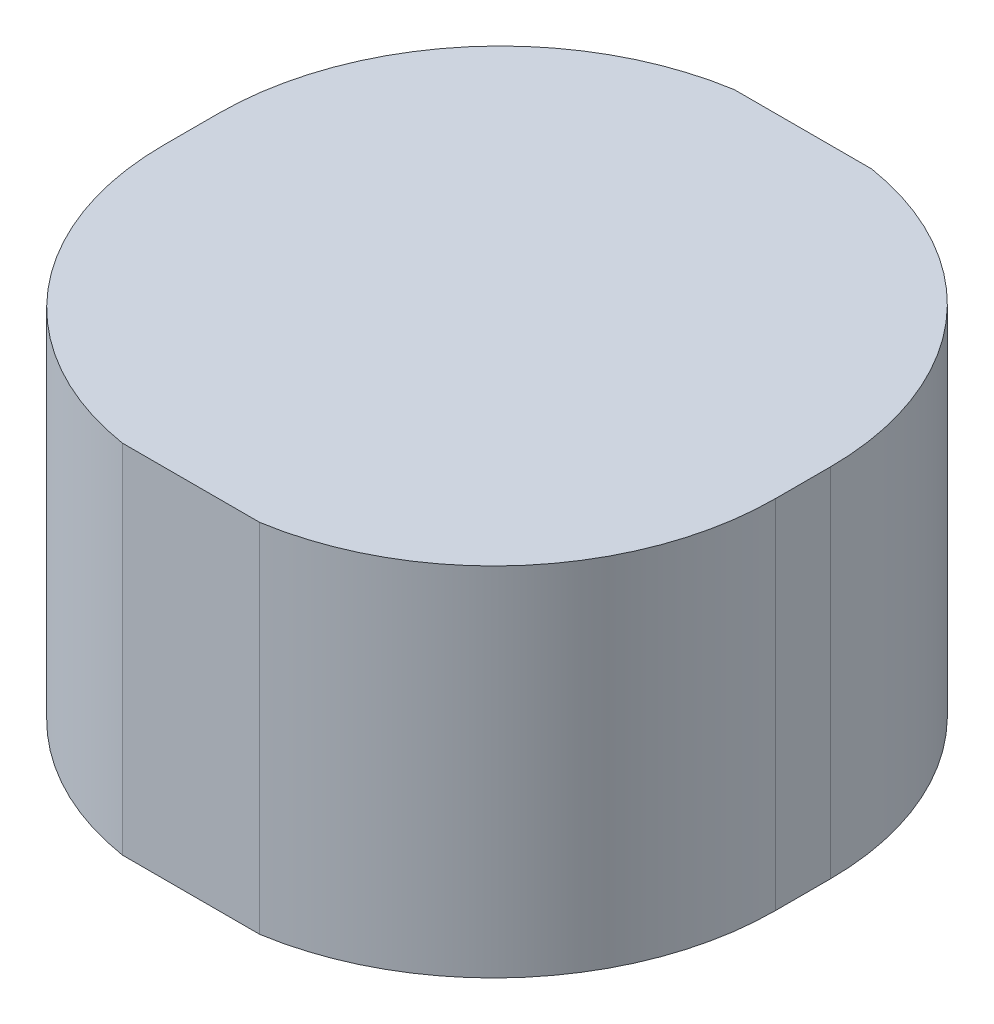
ISO-10303-21;
HEADER;
FILE_DESCRIPTION(('STEP AP214'),'2;1');
FILE_NAME('part.step','',(''),(''),'','','');
FILE_SCHEMA(('AUTOMOTIVE_DESIGN { 1 0 10303 214 1 1 1 1 }'));
ENDSEC;
DATA;
#1=APPLICATION_CONTEXT('core data for automotive mechanical design processes');
#2=APPLICATION_PROTOCOL_DEFINITION('international standard','automotive_design',2000,#1);
#3=PRODUCT_CONTEXT('',#1,'mechanical');
#4=PRODUCT('Part','Part','',(#3));
#5=PRODUCT_RELATED_PRODUCT_CATEGORY('part','',(#4));
#6=PRODUCT_DEFINITION_FORMATION('','',#4);
#7=PRODUCT_DEFINITION_CONTEXT('part definition',#1,'design');
#8=PRODUCT_DEFINITION('design','',#6,#7);
#9=PRODUCT_DEFINITION_SHAPE('','',#8);
#10=(LENGTH_UNIT() NAMED_UNIT(*) SI_UNIT(.MILLI.,.METRE.));
#11=(NAMED_UNIT(*) PLANE_ANGLE_UNIT() SI_UNIT($,.RADIAN.));
#12=(NAMED_UNIT(*) SI_UNIT($,.STERADIAN.) SOLID_ANGLE_UNIT());
#13=UNCERTAINTY_MEASURE_WITH_UNIT(LENGTH_MEASURE(1.E-05),#10,'distance_accuracy_value','');
#14=(GEOMETRIC_REPRESENTATION_CONTEXT(3) GLOBAL_UNCERTAINTY_ASSIGNED_CONTEXT((#13)) GLOBAL_UNIT_ASSIGNED_CONTEXT((#10,
#11,#12)) REPRESENTATION_CONTEXT('',''));
#15=CARTESIAN_POINT('',(0.,0.,0.));
#16=DIRECTION('',(0.,0.,1.));
#17=DIRECTION('',(1.,0.,0.));
#18=AXIS2_PLACEMENT_3D('',#15,#16,#17);
#19=CARTESIAN_POINT('',(-8.69942196531798,130.,-10.));
#20=DIRECTION('',(0.,-1.,0.));
#21=DIRECTION('',(0.,0.,-1.));
#22=AXIS2_PLACEMENT_3D('',#19,#20,#21);
#23=CYLINDRICAL_SURFACE('',#22,102.800578034682);
#24=CARTESIAN_POINT('',(-8.69942196531798,0.,-10.));
#25=DIRECTION('',(0.,1.,0.));
#26=DIRECTION('',(0.,0.,-1.));
#27=AXIS2_PLACEMENT_3D('',#24,#25,#26);
#28=CIRCLE('',#27,102.800578034682);
#29=CARTESIAN_POINT('',(-25.,0.,-111.5));
#30=VERTEX_POINT('',#29);
#31=CARTESIAN_POINT('',(-111.5,0.,-10.));
#32=VERTEX_POINT('',#31);
#33=EDGE_CURVE('E129',#30,#32,#28,.T.);
#34=ORIENTED_EDGE('',*,*,#33,.T.);
#35=DIRECTION('',(0.,-1.,0.));
#36=VECTOR('',#35,1.);
#37=CARTESIAN_POINT('',(-111.5,130.,-10.));
#38=LINE('',#37,#36);
#39=CARTESIAN_POINT('',(-111.5,130.,-10.));
#40=VERTEX_POINT('',#39);
#41=EDGE_CURVE('E11',#40,#32,#38,.T.);
#42=ORIENTED_EDGE('',*,*,#41,.F.);
#43=CARTESIAN_POINT('',(-8.69942196531798,130.,-10.));
#44=DIRECTION('',(0.,1.,0.));
#45=DIRECTION('',(0.,0.,-1.));
#46=AXIS2_PLACEMENT_3D('',#43,#44,#45);
#47=CIRCLE('',#46,102.800578034682);
#48=CARTESIAN_POINT('',(-25.,130.,-111.5));
#49=VERTEX_POINT('',#48);
#50=EDGE_CURVE('E143',#49,#40,#47,.T.);
#51=ORIENTED_EDGE('',*,*,#50,.F.);
#52=DIRECTION('',(0.,-1.,0.));
#53=VECTOR('',#52,1.);
#54=CARTESIAN_POINT('',(-25.,130.,-111.5));
#55=LINE('',#54,#53);
#56=EDGE_CURVE('E125',#49,#30,#55,.T.);
#57=ORIENTED_EDGE('',*,*,#56,.T.);
#58=EDGE_LOOP('',(#34,#42,#51,#57));
#59=FACE_BOUND('',#58,.T.);
#60=ADVANCED_FACE('F33',(#59),#23,.T.);
#61=CARTESIAN_POINT('',(-111.5,130.,10.0000000000001));
#62=DIRECTION('',(1.,0.,0.));
#63=DIRECTION('',(0.,0.,-1.));
#64=AXIS2_PLACEMENT_3D('',#61,#62,#63);
#65=PLANE('',#64);
#66=DIRECTION('',(0.,0.,1.));
#67=VECTOR('',#66,1.);
#68=CARTESIAN_POINT('',(-111.5,0.,10.0000000000001));
#69=LINE('',#68,#67);
#70=CARTESIAN_POINT('',(-111.5,0.,10.0000000000001));
#71=VERTEX_POINT('',#70);
#72=EDGE_CURVE('E132',#32,#71,#69,.T.);
#73=ORIENTED_EDGE('',*,*,#72,.T.);
#74=DIRECTION('',(0.,-1.,0.));
#75=VECTOR('',#74,1.);
#76=CARTESIAN_POINT('',(-111.5,130.,10.0000000000001));
#77=LINE('',#76,#75);
#78=CARTESIAN_POINT('',(-111.5,130.,10.0000000000001));
#79=VERTEX_POINT('',#78);
#80=EDGE_CURVE('E41',#79,#71,#77,.T.);
#81=ORIENTED_EDGE('',*,*,#80,.F.);
#82=DIRECTION('',(0.,0.,1.));
#83=VECTOR('',#82,1.);
#84=CARTESIAN_POINT('',(-111.5,130.,10.0000000000001));
#85=LINE('',#84,#83);
#86=EDGE_CURVE('E92',#40,#79,#85,.T.);
#87=ORIENTED_EDGE('',*,*,#86,.F.);
#88=ORIENTED_EDGE('',*,*,#41,.T.);
#89=EDGE_LOOP('',(#73,#81,#87,#88));
#90=FACE_BOUND('',#89,.T.);
#91=ADVANCED_FACE('F178',(#90),#65,.F.);
#92=CARTESIAN_POINT('',(-8.69942196531797,130.,10.));
#93=DIRECTION('',(0.,-1.,0.));
#94=DIRECTION('',(0.,0.,-1.));
#95=AXIS2_PLACEMENT_3D('',#92,#93,#94);
#96=CYLINDRICAL_SURFACE('',#95,102.800578034682);
#97=CARTESIAN_POINT('',(-8.69942196531797,0.,10.));
#98=DIRECTION('',(0.,1.,0.));
#99=DIRECTION('',(0.,0.,1.));
#100=AXIS2_PLACEMENT_3D('',#97,#98,#99);
#101=CIRCLE('',#100,102.800578034682);
#102=CARTESIAN_POINT('',(-25.,0.,111.5));
#103=VERTEX_POINT('',#102);
#104=EDGE_CURVE('E134',#71,#103,#101,.T.);
#105=ORIENTED_EDGE('',*,*,#104,.T.);
#106=DIRECTION('',(0.,-1.,0.));
#107=VECTOR('',#106,1.);
#108=CARTESIAN_POINT('',(-25.,130.,111.5));
#109=LINE('',#108,#107);
#110=CARTESIAN_POINT('',(-25.,130.,111.5));
#111=VERTEX_POINT('',#110);
#112=EDGE_CURVE('E150',#111,#103,#109,.T.);
#113=ORIENTED_EDGE('',*,*,#112,.F.);
#114=CARTESIAN_POINT('',(-8.69942196531797,130.,10.));
#115=DIRECTION('',(0.,1.,0.));
#116=DIRECTION('',(0.,0.,1.));
#117=AXIS2_PLACEMENT_3D('',#114,#115,#116);
#118=CIRCLE('',#117,102.800578034682);
#119=EDGE_CURVE('E158',#79,#111,#118,.T.);
#120=ORIENTED_EDGE('',*,*,#119,.F.);
#121=ORIENTED_EDGE('',*,*,#80,.T.);
#122=EDGE_LOOP('',(#105,#113,#120,#121));
#123=FACE_BOUND('',#122,.T.);
#124=ADVANCED_FACE('F156',(#123),#96,.T.);
#125=CARTESIAN_POINT('',(25.,130.,111.5));
#126=DIRECTION('',(0.,0.,-1.));
#127=DIRECTION('',(-1.,0.,0.));
#128=AXIS2_PLACEMENT_3D('',#125,#126,#127);
#129=PLANE('',#128);
#130=DIRECTION('',(1.,0.,0.));
#131=VECTOR('',#130,1.);
#132=CARTESIAN_POINT('',(25.,0.,111.5));
#133=LINE('',#132,#131);
#134=CARTESIAN_POINT('',(25.,0.,111.5));
#135=VERTEX_POINT('',#134);
#136=EDGE_CURVE('E136',#103,#135,#133,.T.);
#137=ORIENTED_EDGE('',*,*,#136,.T.);
#138=DIRECTION('',(0.,-1.,0.));
#139=VECTOR('',#138,1.);
#140=CARTESIAN_POINT('',(25.,130.,111.5));
#141=LINE('',#140,#139);
#142=CARTESIAN_POINT('',(25.,130.,111.5));
#143=VERTEX_POINT('',#142);
#144=EDGE_CURVE('E147',#143,#135,#141,.T.);
#145=ORIENTED_EDGE('',*,*,#144,.F.);
#146=DIRECTION('',(1.,0.,0.));
#147=VECTOR('',#146,1.);
#148=CARTESIAN_POINT('',(25.,130.,111.5));
#149=LINE('',#148,#147);
#150=EDGE_CURVE('E170',#111,#143,#149,.T.);
#151=ORIENTED_EDGE('',*,*,#150,.F.);
#152=ORIENTED_EDGE('',*,*,#112,.T.);
#153=EDGE_LOOP('',(#137,#145,#151,#152));
#154=FACE_BOUND('',#153,.T.);
#155=ADVANCED_FACE('F166',(#154),#129,.F.);
#156=CARTESIAN_POINT('',(8.69942196531802,130.,10.));
#157=DIRECTION('',(0.,-1.,0.));
#158=DIRECTION('',(0.,0.,-1.));
#159=AXIS2_PLACEMENT_3D('',#156,#157,#158);
#160=CYLINDRICAL_SURFACE('',#159,102.800578034682);
#161=CARTESIAN_POINT('',(8.69942196531802,0.,10.));
#162=DIRECTION('',(0.,1.,0.));
#163=DIRECTION('',(0.,0.,-1.));
#164=AXIS2_PLACEMENT_3D('',#161,#162,#163);
#165=CIRCLE('',#164,102.800578034682);
#166=CARTESIAN_POINT('',(111.5,0.,10.));
#167=VERTEX_POINT('',#166);
#168=EDGE_CURVE('E138',#135,#167,#165,.T.);
#169=ORIENTED_EDGE('',*,*,#168,.T.);
#170=DIRECTION('',(0.,-1.,0.));
#171=VECTOR('',#170,1.);
#172=CARTESIAN_POINT('',(111.5,130.,10.));
#173=LINE('',#172,#171);
#174=CARTESIAN_POINT('',(111.5,130.,10.));
#175=VERTEX_POINT('',#174);
#176=EDGE_CURVE('E120',#175,#167,#173,.T.);
#177=ORIENTED_EDGE('',*,*,#176,.F.);
#178=CARTESIAN_POINT('',(8.69942196531802,130.,10.));
#179=DIRECTION('',(0.,1.,0.));
#180=DIRECTION('',(0.,0.,-1.));
#181=AXIS2_PLACEMENT_3D('',#178,#179,#180);
#182=CIRCLE('',#181,102.800578034682);
#183=EDGE_CURVE('E111',#143,#175,#182,.T.);
#184=ORIENTED_EDGE('',*,*,#183,.F.);
#185=ORIENTED_EDGE('',*,*,#144,.T.);
#186=EDGE_LOOP('',(#169,#177,#184,#185));
#187=FACE_BOUND('',#186,.T.);
#188=ADVANCED_FACE('F169',(#187),#160,.T.);
#189=CARTESIAN_POINT('',(111.5,130.,10.));
#190=DIRECTION('',(-1.,0.,0.));
#191=DIRECTION('',(0.,0.,1.));
#192=AXIS2_PLACEMENT_3D('',#189,#190,#191);
#193=PLANE('',#192);
#194=DIRECTION('',(0.,0.,-1.));
#195=VECTOR('',#194,1.);
#196=CARTESIAN_POINT('',(111.5,0.,10.));
#197=LINE('',#196,#195);
#198=CARTESIAN_POINT('',(111.5,0.,-10.));
#199=VERTEX_POINT('',#198);
#200=EDGE_CURVE('E119',#167,#199,#197,.T.);
#201=ORIENTED_EDGE('',*,*,#200,.T.);
#202=DIRECTION('',(0.,-1.,0.));
#203=VECTOR('',#202,1.);
#204=CARTESIAN_POINT('',(111.5,130.,-10.));
#205=LINE('',#204,#203);
#206=CARTESIAN_POINT('',(111.5,130.,-10.));
#207=VERTEX_POINT('',#206);
#208=EDGE_CURVE('E116',#207,#199,#205,.T.);
#209=ORIENTED_EDGE('',*,*,#208,.F.);
#210=DIRECTION('',(0.,0.,-1.));
#211=VECTOR('',#210,1.);
#212=CARTESIAN_POINT('',(111.5,130.,10.));
#213=LINE('',#212,#211);
#214=EDGE_CURVE('E105',#175,#207,#213,.T.);
#215=ORIENTED_EDGE('',*,*,#214,.F.);
#216=ORIENTED_EDGE('',*,*,#176,.T.);
#217=EDGE_LOOP('',(#201,#209,#215,#216));
#218=FACE_BOUND('',#217,.T.);
#219=ADVANCED_FACE('F117',(#218),#193,.F.);
#220=CARTESIAN_POINT('',(8.69942196531802,130.,-10.));
#221=DIRECTION('',(0.,-1.,0.));
#222=DIRECTION('',(0.,0.,-1.));
#223=AXIS2_PLACEMENT_3D('',#220,#221,#222);
#224=CYLINDRICAL_SURFACE('',#223,102.800578034682);
#225=CARTESIAN_POINT('',(8.69942196531802,0.,-10.));
#226=DIRECTION('',(0.,1.,0.));
#227=DIRECTION('',(0.,0.,1.));
#228=AXIS2_PLACEMENT_3D('',#225,#226,#227);
#229=CIRCLE('',#228,102.800578034682);
#230=CARTESIAN_POINT('',(25.,0.,-111.5));
#231=VERTEX_POINT('',#230);
#232=EDGE_CURVE('E78',#199,#231,#229,.T.);
#233=ORIENTED_EDGE('',*,*,#232,.T.);
#234=DIRECTION('',(0.,-1.,0.));
#235=VECTOR('',#234,1.);
#236=CARTESIAN_POINT('',(25.,130.,-111.5));
#237=LINE('',#236,#235);
#238=CARTESIAN_POINT('',(25.,130.,-111.5));
#239=VERTEX_POINT('',#238);
#240=EDGE_CURVE('E121',#239,#231,#237,.T.);
#241=ORIENTED_EDGE('',*,*,#240,.F.);
#242=CARTESIAN_POINT('',(8.69942196531802,130.,-10.));
#243=DIRECTION('',(0.,1.,0.));
#244=DIRECTION('',(0.,0.,1.));
#245=AXIS2_PLACEMENT_3D('',#242,#243,#244);
#246=CIRCLE('',#245,102.800578034682);
#247=EDGE_CURVE('E109',#207,#239,#246,.T.);
#248=ORIENTED_EDGE('',*,*,#247,.F.);
#249=ORIENTED_EDGE('',*,*,#208,.T.);
#250=EDGE_LOOP('',(#233,#241,#248,#249));
#251=FACE_BOUND('',#250,.T.);
#252=ADVANCED_FACE('F123',(#251),#224,.T.);
#253=CARTESIAN_POINT('',(25.,130.,-111.5));
#254=DIRECTION('',(0.,0.,1.));
#255=DIRECTION('',(1.,0.,0.));
#256=AXIS2_PLACEMENT_3D('',#253,#254,#255);
#257=PLANE('',#256);
#258=DIRECTION('',(-1.,0.,0.));
#259=VECTOR('',#258,1.);
#260=CARTESIAN_POINT('',(25.,0.,-111.5));
#261=LINE('',#260,#259);
#262=EDGE_CURVE('E84',#231,#30,#261,.T.);
#263=ORIENTED_EDGE('',*,*,#262,.T.);
#264=ORIENTED_EDGE('',*,*,#56,.F.);
#265=DIRECTION('',(-1.,0.,0.));
#266=VECTOR('',#265,1.);
#267=CARTESIAN_POINT('',(25.,130.,-111.5));
#268=LINE('',#267,#266);
#269=EDGE_CURVE('E49',#239,#49,#268,.T.);
#270=ORIENTED_EDGE('',*,*,#269,.F.);
#271=ORIENTED_EDGE('',*,*,#240,.T.);
#272=EDGE_LOOP('',(#263,#264,#270,#271));
#273=FACE_BOUND('',#272,.T.);
#274=ADVANCED_FACE('F194',(#273),#257,.F.);
#275=CARTESIAN_POINT('',(-8.69942196531798,130.,-10.));
#276=DIRECTION('',(0.,-1.,0.));
#277=DIRECTION('',(0.,0.,-1.));
#278=AXIS2_PLACEMENT_3D('',#275,#276,#277);
#279=PLANE('',#278);
#280=ORIENTED_EDGE('',*,*,#50,.T.);
#281=ORIENTED_EDGE('',*,*,#86,.T.);
#282=ORIENTED_EDGE('',*,*,#119,.T.);
#283=ORIENTED_EDGE('',*,*,#150,.T.);
#284=ORIENTED_EDGE('',*,*,#183,.T.);
#285=ORIENTED_EDGE('',*,*,#214,.T.);
#286=ORIENTED_EDGE('',*,*,#247,.T.);
#287=ORIENTED_EDGE('',*,*,#269,.T.);
#288=EDGE_LOOP('',(#280,#281,#282,#283,#284,#285,#286,#287));
#289=FACE_BOUND('',#288,.T.);
#290=ADVANCED_FACE('F107',(#289),#279,.F.);
#291=CARTESIAN_POINT('',(-8.69942196531798,0.,-10.));
#292=DIRECTION('',(0.,-1.,0.));
#293=DIRECTION('',(0.,0.,-1.));
#294=AXIS2_PLACEMENT_3D('',#291,#292,#293);
#295=PLANE('',#294);
#296=ORIENTED_EDGE('',*,*,#33,.F.);
#297=ORIENTED_EDGE('',*,*,#262,.F.);
#298=ORIENTED_EDGE('',*,*,#232,.F.);
#299=ORIENTED_EDGE('',*,*,#200,.F.);
#300=ORIENTED_EDGE('',*,*,#168,.F.);
#301=ORIENTED_EDGE('',*,*,#136,.F.);
#302=ORIENTED_EDGE('',*,*,#104,.F.);
#303=ORIENTED_EDGE('',*,*,#72,.F.);
#304=EDGE_LOOP('',(#296,#297,#298,#299,#300,#301,#302,#303));
#305=FACE_BOUND('',#304,.T.);
#306=ADVANCED_FACE('F162',(#305),#295,.T.);
#307=CLOSED_SHELL('',(#60,#91,#124,#155,#188,#219,#252,#274,#290,#306));
#308=MANIFOLD_SOLID_BREP('B2',#307);
#309=ADVANCED_BREP_SHAPE_REPRESENTATION('',(#18,#308),#14);
#310=SHAPE_DEFINITION_REPRESENTATION(#9,#309);
ENDSEC;
END-ISO-10303-21;
